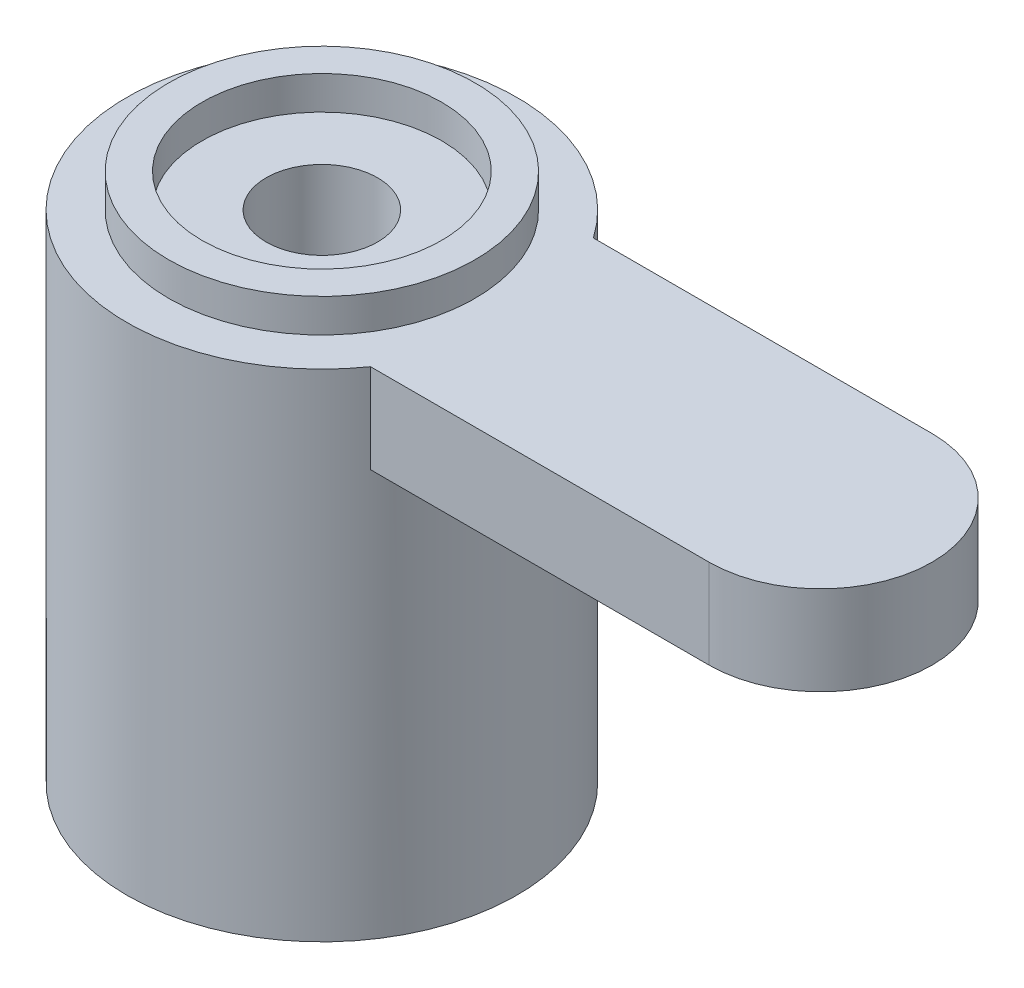
ISO-10303-21;
HEADER;
FILE_DESCRIPTION(('STEP AP214'),'2;1');
FILE_NAME('part.step','',(''),(''),'','','');
FILE_SCHEMA(('AUTOMOTIVE_DESIGN { 1 0 10303 214 1 1 1 1 }'));
ENDSEC;
DATA;
#1=APPLICATION_CONTEXT('core data for automotive mechanical design processes');
#2=APPLICATION_PROTOCOL_DEFINITION('international standard','automotive_design',2000,#1);
#3=PRODUCT_CONTEXT('',#1,'mechanical');
#4=PRODUCT('Part','Part','',(#3));
#5=PRODUCT_RELATED_PRODUCT_CATEGORY('part','',(#4));
#6=PRODUCT_DEFINITION_FORMATION('','',#4);
#7=PRODUCT_DEFINITION_CONTEXT('part definition',#1,'design');
#8=PRODUCT_DEFINITION('design','',#6,#7);
#9=PRODUCT_DEFINITION_SHAPE('','',#8);
#10=(LENGTH_UNIT() NAMED_UNIT(*) SI_UNIT(.MILLI.,.METRE.));
#11=(NAMED_UNIT(*) PLANE_ANGLE_UNIT() SI_UNIT($,.RADIAN.));
#12=(NAMED_UNIT(*) SI_UNIT($,.STERADIAN.) SOLID_ANGLE_UNIT());
#13=UNCERTAINTY_MEASURE_WITH_UNIT(LENGTH_MEASURE(1.E-05),#10,'distance_accuracy_value','');
#14=(GEOMETRIC_REPRESENTATION_CONTEXT(3) GLOBAL_UNCERTAINTY_ASSIGNED_CONTEXT((#13)) GLOBAL_UNIT_ASSIGNED_CONTEXT((#10,
#11,#12)) REPRESENTATION_CONTEXT('',''));
#15=CARTESIAN_POINT('',(0.,0.,0.));
#16=DIRECTION('',(0.,0.,1.));
#17=DIRECTION('',(1.,0.,0.));
#18=AXIS2_PLACEMENT_3D('',#15,#16,#17);
#19=CARTESIAN_POINT('',(0.,9.5,0.));
#20=DIRECTION('',(0.,-1.,0.));
#21=DIRECTION('',(0.,0.,-1.));
#22=AXIS2_PLACEMENT_3D('',#19,#20,#21);
#23=CYLINDRICAL_SURFACE('',#22,3.5);
#24=CARTESIAN_POINT('',(0.,8.9,0.));
#25=DIRECTION('',(0.,1.,0.));
#26=DIRECTION('',(0.,0.,1.));
#27=AXIS2_PLACEMENT_3D('',#24,#25,#26);
#28=CIRCLE('',#27,3.5);
#29=CARTESIAN_POINT('',(2.87228132326901,8.9,2.));
#30=VERTEX_POINT('',#29);
#31=CARTESIAN_POINT('',(2.87228132326901,8.9,-2.));
#32=VERTEX_POINT('',#31);
#33=EDGE_CURVE('E69',#30,#32,#28,.F.);
#34=ORIENTED_EDGE('',*,*,#33,.T.);
#35=DIRECTION('',(0.,-1.,0.));
#36=VECTOR('',#35,1.);
#37=CARTESIAN_POINT('',(2.87228132326901,9.5,-2.));
#38=LINE('',#37,#36);
#39=CARTESIAN_POINT('',(2.87228132326901,7.3,-2.));
#40=VERTEX_POINT('',#39);
#41=EDGE_CURVE('E73',#40,#32,#38,.F.);
#42=ORIENTED_EDGE('',*,*,#41,.F.);
#43=CARTESIAN_POINT('',(0.,7.3,0.));
#44=DIRECTION('',(0.,1.,0.));
#45=DIRECTION('',(0.,0.,1.));
#46=AXIS2_PLACEMENT_3D('',#43,#44,#45);
#47=CIRCLE('',#46,3.5);
#48=CARTESIAN_POINT('',(2.87228132326901,7.3,2.));
#49=VERTEX_POINT('',#48);
#50=EDGE_CURVE('E11',#49,#40,#47,.T.);
#51=ORIENTED_EDGE('',*,*,#50,.F.);
#52=DIRECTION('',(0.,-1.,0.));
#53=VECTOR('',#52,1.);
#54=CARTESIAN_POINT('',(2.87228132326901,9.5,2.));
#55=LINE('',#54,#53);
#56=EDGE_CURVE('E39',#49,#30,#55,.F.);
#57=ORIENTED_EDGE('',*,*,#56,.T.);
#58=EDGE_LOOP('',(#34,#42,#51,#57));
#59=FACE_BOUND('',#58,.T.);
#60=CARTESIAN_POINT('',(0.,0.,0.));
#61=DIRECTION('',(0.,1.,0.));
#62=DIRECTION('',(0.,0.,1.));
#63=AXIS2_PLACEMENT_3D('',#60,#61,#62);
#64=CIRCLE('',#63,3.5);
#65=CARTESIAN_POINT('',(0.,0.,3.5));
#66=VERTEX_POINT('',#65);
#67=EDGE_CURVE('E92',#66,#66,#64,.T.);
#68=ORIENTED_EDGE('',*,*,#67,.T.);
#69=EDGE_LOOP('',(#68));
#70=FACE_BOUND('',#69,.T.);
#71=ADVANCED_FACE('F32',(#59,#70),#23,.T.);
#72=CARTESIAN_POINT('',(0.,9.5,0.));
#73=DIRECTION('',(0.,1.,0.));
#74=DIRECTION('',(0.,0.,1.));
#75=AXIS2_PLACEMENT_3D('',#72,#73,#74);
#76=PLANE('',#75);
#77=CARTESIAN_POINT('',(0.,9.5,0.));
#78=DIRECTION('',(0.,1.,0.));
#79=DIRECTION('',(0.,0.,1.));
#80=AXIS2_PLACEMENT_3D('',#77,#78,#79);
#81=CIRCLE('',#80,2.15);
#82=CARTESIAN_POINT('',(0.,9.5,2.15));
#83=VERTEX_POINT('',#82);
#84=EDGE_CURVE('E118',#83,#83,#81,.T.);
#85=ORIENTED_EDGE('',*,*,#84,.F.);
#86=EDGE_LOOP('',(#85));
#87=FACE_BOUND('',#86,.T.);
#88=CARTESIAN_POINT('',(0.,9.5,0.));
#89=DIRECTION('',(0.,1.,0.));
#90=DIRECTION('',(0.,0.,1.));
#91=AXIS2_PLACEMENT_3D('',#88,#89,#90);
#92=CIRCLE('',#91,2.75);
#93=CARTESIAN_POINT('',(0.,9.5,2.75));
#94=VERTEX_POINT('',#93);
#95=EDGE_CURVE('E76',#94,#94,#92,.T.);
#96=ORIENTED_EDGE('',*,*,#95,.T.);
#97=EDGE_LOOP('',(#96));
#98=FACE_BOUND('',#97,.T.);
#99=ADVANCED_FACE('F132',(#87,#98),#76,.T.);
#100=CARTESIAN_POINT('',(0.,0.,0.));
#101=DIRECTION('',(0.,1.,0.));
#102=DIRECTION('',(0.,0.,1.));
#103=AXIS2_PLACEMENT_3D('',#100,#101,#102);
#104=PLANE('',#103);
#105=CARTESIAN_POINT('',(0.,0.,0.));
#106=DIRECTION('',(0.,-1.,0.));
#107=DIRECTION('',(0.,0.,-1.));
#108=AXIS2_PLACEMENT_3D('',#105,#106,#107);
#109=CIRCLE('',#108,1.9);
#110=CARTESIAN_POINT('',(0.,0.,-1.9));
#111=VERTEX_POINT('',#110);
#112=EDGE_CURVE('E98',#111,#111,#109,.T.);
#113=ORIENTED_EDGE('',*,*,#112,.F.);
#114=EDGE_LOOP('',(#113));
#115=FACE_BOUND('',#114,.T.);
#116=ORIENTED_EDGE('',*,*,#67,.F.);
#117=EDGE_LOOP('',(#116));
#118=FACE_BOUND('',#117,.T.);
#119=ADVANCED_FACE('F150',(#115,#118),#104,.F.);
#120=CARTESIAN_POINT('',(0.,3.5,0.));
#121=DIRECTION('',(0.,-1.,0.));
#122=DIRECTION('',(0.,0.,-1.));
#123=AXIS2_PLACEMENT_3D('',#120,#121,#122);
#124=CYLINDRICAL_SURFACE('',#123,1.9);
#125=CARTESIAN_POINT('',(0.,3.5,0.));
#126=DIRECTION('',(0.,-1.,0.));
#127=DIRECTION('',(0.,0.,-1.));
#128=AXIS2_PLACEMENT_3D('',#125,#126,#127);
#129=CIRCLE('',#128,1.9);
#130=CARTESIAN_POINT('',(0.,3.5,-1.9));
#131=VERTEX_POINT('',#130);
#132=EDGE_CURVE('E95',#131,#131,#129,.T.);
#133=ORIENTED_EDGE('',*,*,#132,.F.);
#134=EDGE_LOOP('',(#133));
#135=FACE_BOUND('',#134,.T.);
#136=ORIENTED_EDGE('',*,*,#112,.T.);
#137=EDGE_LOOP('',(#136));
#138=FACE_BOUND('',#137,.T.);
#139=ADVANCED_FACE('F156',(#135,#138),#124,.F.);
#140=CARTESIAN_POINT('',(0.,3.5,0.));
#141=DIRECTION('',(0.,-1.,0.));
#142=DIRECTION('',(0.,0.,-1.));
#143=AXIS2_PLACEMENT_3D('',#140,#141,#142);
#144=PLANE('',#143);
#145=CARTESIAN_POINT('',(0.,3.5,0.));
#146=DIRECTION('',(0.,-1.,0.));
#147=DIRECTION('',(0.,0.,-1.));
#148=AXIS2_PLACEMENT_3D('',#145,#146,#147);
#149=CIRCLE('',#148,1.);
#150=CARTESIAN_POINT('',(0.,3.5,-1.));
#151=VERTEX_POINT('',#150);
#152=EDGE_CURVE('E121',#151,#151,#149,.T.);
#153=ORIENTED_EDGE('',*,*,#152,.F.);
#154=EDGE_LOOP('',(#153));
#155=FACE_BOUND('',#154,.T.);
#156=ORIENTED_EDGE('',*,*,#132,.T.);
#157=EDGE_LOOP('',(#156));
#158=FACE_BOUND('',#157,.T.);
#159=ADVANCED_FACE('F162',(#155,#158),#144,.T.);
#160=CARTESIAN_POINT('',(0.,8.9,0.));
#161=DIRECTION('',(0.,1.,0.));
#162=DIRECTION('',(0.,0.,1.));
#163=AXIS2_PLACEMENT_3D('',#160,#161,#162);
#164=PLANE('',#163);
#165=DIRECTION('',(1.,0.,0.));
#166=VECTOR('',#165,1.);
#167=CARTESIAN_POINT('',(0.,8.9,-2.));
#168=LINE('',#167,#166);
#169=CARTESIAN_POINT('',(8.95,8.9,-2.));
#170=VERTEX_POINT('',#169);
#171=EDGE_CURVE('E79',#32,#170,#168,.T.);
#172=ORIENTED_EDGE('',*,*,#171,.F.);
#173=ORIENTED_EDGE('',*,*,#33,.F.);
#174=DIRECTION('',(1.,0.,0.));
#175=VECTOR('',#174,1.);
#176=CARTESIAN_POINT('',(0.,8.9,2.));
#177=LINE('',#176,#175);
#178=CARTESIAN_POINT('',(8.95,8.9,2.));
#179=VERTEX_POINT('',#178);
#180=EDGE_CURVE('E110',#30,#179,#177,.T.);
#181=ORIENTED_EDGE('',*,*,#180,.T.);
#182=CARTESIAN_POINT('',(8.95,8.9,0.));
#183=DIRECTION('',(0.,1.,0.));
#184=DIRECTION('',(0.,0.,1.));
#185=AXIS2_PLACEMENT_3D('',#182,#183,#184);
#186=CIRCLE('',#185,2.);
#187=EDGE_CURVE('E83',#179,#170,#186,.T.);
#188=ORIENTED_EDGE('',*,*,#187,.T.);
#189=EDGE_LOOP('',(#172,#173,#181,#188));
#190=FACE_BOUND('',#189,.T.);
#191=CARTESIAN_POINT('',(0.,8.9,0.));
#192=DIRECTION('',(0.,1.,0.));
#193=DIRECTION('',(0.,0.,1.));
#194=AXIS2_PLACEMENT_3D('',#191,#192,#193);
#195=CIRCLE('',#194,2.75);
#196=CARTESIAN_POINT('',(0.,8.9,2.75));
#197=VERTEX_POINT('',#196);
#198=EDGE_CURVE('E75',#197,#197,#195,.F.);
#199=ORIENTED_EDGE('',*,*,#198,.T.);
#200=EDGE_LOOP('',(#199));
#201=FACE_BOUND('',#200,.T.);
#202=ADVANCED_FACE('F80',(#190,#201),#164,.T.);
#203=CARTESIAN_POINT('',(0.,7.3,2.));
#204=DIRECTION('',(0.,0.,1.));
#205=DIRECTION('',(1.,0.,0.));
#206=AXIS2_PLACEMENT_3D('',#203,#204,#205);
#207=PLANE('',#206);
#208=ORIENTED_EDGE('',*,*,#56,.F.);
#209=DIRECTION('',(1.,0.,0.));
#210=VECTOR('',#209,1.);
#211=CARTESIAN_POINT('',(0.,7.3,2.));
#212=LINE('',#211,#210);
#213=CARTESIAN_POINT('',(8.95,7.3,2.));
#214=VERTEX_POINT('',#213);
#215=EDGE_CURVE('E103',#49,#214,#212,.T.);
#216=ORIENTED_EDGE('',*,*,#215,.T.);
#217=DIRECTION('',(0.,1.,0.));
#218=VECTOR('',#217,1.);
#219=CARTESIAN_POINT('',(8.95,7.3,2.));
#220=LINE('',#219,#218);
#221=EDGE_CURVE('E88',#214,#179,#220,.T.);
#222=ORIENTED_EDGE('',*,*,#221,.T.);
#223=ORIENTED_EDGE('',*,*,#180,.F.);
#224=EDGE_LOOP('',(#208,#216,#222,#223));
#225=FACE_BOUND('',#224,.T.);
#226=ADVANCED_FACE('F169',(#225),#207,.T.);
#227=CARTESIAN_POINT('',(0.,7.3,-2.));
#228=DIRECTION('',(0.,0.,1.));
#229=DIRECTION('',(1.,0.,0.));
#230=AXIS2_PLACEMENT_3D('',#227,#228,#229);
#231=PLANE('',#230);
#232=DIRECTION('',(1.,0.,0.));
#233=VECTOR('',#232,1.);
#234=CARTESIAN_POINT('',(0.,7.3,-2.));
#235=LINE('',#234,#233);
#236=CARTESIAN_POINT('',(8.95,7.3,-2.));
#237=VERTEX_POINT('',#236);
#238=EDGE_CURVE('E91',#40,#237,#235,.T.);
#239=ORIENTED_EDGE('',*,*,#238,.F.);
#240=ORIENTED_EDGE('',*,*,#41,.T.);
#241=ORIENTED_EDGE('',*,*,#171,.T.);
#242=DIRECTION('',(0.,1.,0.));
#243=VECTOR('',#242,1.);
#244=CARTESIAN_POINT('',(8.95,7.3,-2.));
#245=LINE('',#244,#243);
#246=EDGE_CURVE('E108',#237,#170,#245,.T.);
#247=ORIENTED_EDGE('',*,*,#246,.F.);
#248=EDGE_LOOP('',(#239,#240,#241,#247));
#249=FACE_BOUND('',#248,.T.);
#250=ADVANCED_FACE('F90',(#249),#231,.F.);
#251=CARTESIAN_POINT('',(8.95,7.3,0.));
#252=DIRECTION('',(0.,1.,0.));
#253=DIRECTION('',(0.,0.,1.));
#254=AXIS2_PLACEMENT_3D('',#251,#252,#253);
#255=CYLINDRICAL_SURFACE('',#254,2.);
#256=ORIENTED_EDGE('',*,*,#187,.F.);
#257=ORIENTED_EDGE('',*,*,#221,.F.);
#258=CARTESIAN_POINT('',(8.95,7.3,0.));
#259=DIRECTION('',(0.,1.,0.));
#260=DIRECTION('',(0.,0.,1.));
#261=AXIS2_PLACEMENT_3D('',#258,#259,#260);
#262=CIRCLE('',#261,2.);
#263=EDGE_CURVE('E87',#214,#237,#262,.T.);
#264=ORIENTED_EDGE('',*,*,#263,.T.);
#265=ORIENTED_EDGE('',*,*,#246,.T.);
#266=EDGE_LOOP('',(#256,#257,#264,#265));
#267=FACE_BOUND('',#266,.T.);
#268=ADVANCED_FACE('F174',(#267),#255,.T.);
#269=CARTESIAN_POINT('',(0.,7.3,0.));
#270=DIRECTION('',(0.,1.,0.));
#271=DIRECTION('',(0.,0.,1.));
#272=AXIS2_PLACEMENT_3D('',#269,#270,#271);
#273=PLANE('',#272);
#274=ORIENTED_EDGE('',*,*,#215,.F.);
#275=ORIENTED_EDGE('',*,*,#50,.T.);
#276=ORIENTED_EDGE('',*,*,#238,.T.);
#277=ORIENTED_EDGE('',*,*,#263,.F.);
#278=EDGE_LOOP('',(#274,#275,#276,#277));
#279=FACE_BOUND('',#278,.T.);
#280=ADVANCED_FACE('F170',(#279),#273,.F.);
#281=CARTESIAN_POINT('',(0.,2.81888168179569,0.));
#282=DIRECTION('',(0.,1.,0.));
#283=DIRECTION('',(0.,0.,1.));
#284=AXIS2_PLACEMENT_3D('',#281,#282,#283);
#285=CYLINDRICAL_SURFACE('',#284,2.15);
#286=CARTESIAN_POINT('',(0.,8.9,0.));
#287=DIRECTION('',(0.,1.,0.));
#288=DIRECTION('',(0.,0.,1.));
#289=AXIS2_PLACEMENT_3D('',#286,#287,#288);
#290=CIRCLE('',#289,2.15);
#291=CARTESIAN_POINT('',(0.,8.9,2.15));
#292=VERTEX_POINT('',#291);
#293=EDGE_CURVE('E105',#292,#292,#290,.F.);
#294=ORIENTED_EDGE('',*,*,#293,.T.);
#295=EDGE_LOOP('',(#294));
#296=FACE_BOUND('',#295,.T.);
#297=ORIENTED_EDGE('',*,*,#84,.T.);
#298=EDGE_LOOP('',(#297));
#299=FACE_BOUND('',#298,.T.);
#300=ADVANCED_FACE('F173',(#296,#299),#285,.F.);
#301=CARTESIAN_POINT('',(0.,8.9,0.));
#302=DIRECTION('',(0.,1.,0.));
#303=DIRECTION('',(0.,0.,1.));
#304=AXIS2_PLACEMENT_3D('',#301,#302,#303);
#305=PLANE('',#304);
#306=CARTESIAN_POINT('',(0.,8.9,0.));
#307=DIRECTION('',(0.,1.,0.));
#308=DIRECTION('',(0.,0.,1.));
#309=AXIS2_PLACEMENT_3D('',#306,#307,#308);
#310=CIRCLE('',#309,1.);
#311=CARTESIAN_POINT('',(0.,8.9,1.));
#312=VERTEX_POINT('',#311);
#313=EDGE_CURVE('E124',#312,#312,#310,.T.);
#314=ORIENTED_EDGE('',*,*,#313,.F.);
#315=EDGE_LOOP('',(#314));
#316=FACE_BOUND('',#315,.T.);
#317=ORIENTED_EDGE('',*,*,#293,.F.);
#318=EDGE_LOOP('',(#317));
#319=FACE_BOUND('',#318,.T.);
#320=ADVANCED_FACE('F142',(#316,#319),#305,.T.);
#321=CARTESIAN_POINT('',(0.,-22.7,0.));
#322=DIRECTION('',(0.,1.,0.));
#323=DIRECTION('',(0.,0.,1.));
#324=AXIS2_PLACEMENT_3D('',#321,#322,#323);
#325=CYLINDRICAL_SURFACE('',#324,1.);
#326=ORIENTED_EDGE('',*,*,#152,.T.);
#327=EDGE_LOOP('',(#326));
#328=FACE_BOUND('',#327,.T.);
#329=ORIENTED_EDGE('',*,*,#313,.T.);
#330=EDGE_LOOP('',(#329));
#331=FACE_BOUND('',#330,.T.);
#332=ADVANCED_FACE('F136',(#328,#331),#325,.F.);
#333=CARTESIAN_POINT('',(0.,-0.999494936611667,0.));
#334=DIRECTION('',(0.,1.,0.));
#335=DIRECTION('',(0.,0.,1.));
#336=AXIS2_PLACEMENT_3D('',#333,#334,#335);
#337=CYLINDRICAL_SURFACE('',#336,2.75);
#338=ORIENTED_EDGE('',*,*,#198,.F.);
#339=EDGE_LOOP('',(#338));
#340=FACE_BOUND('',#339,.T.);
#341=ORIENTED_EDGE('',*,*,#95,.F.);
#342=EDGE_LOOP('',(#341));
#343=FACE_BOUND('',#342,.T.);
#344=ADVANCED_FACE('F134',(#340,#343),#337,.T.);
#345=CLOSED_SHELL('',(#71,#99,#119,#139,#159,#202,#226,#250,#268,#280,#300,#320,#332,#344));
#346=MANIFOLD_SOLID_BREP('B2',#345);
#347=ADVANCED_BREP_SHAPE_REPRESENTATION('',(#18,#346),#14);
#348=SHAPE_DEFINITION_REPRESENTATION(#9,#347);
ENDSEC;
END-ISO-10303-21;
